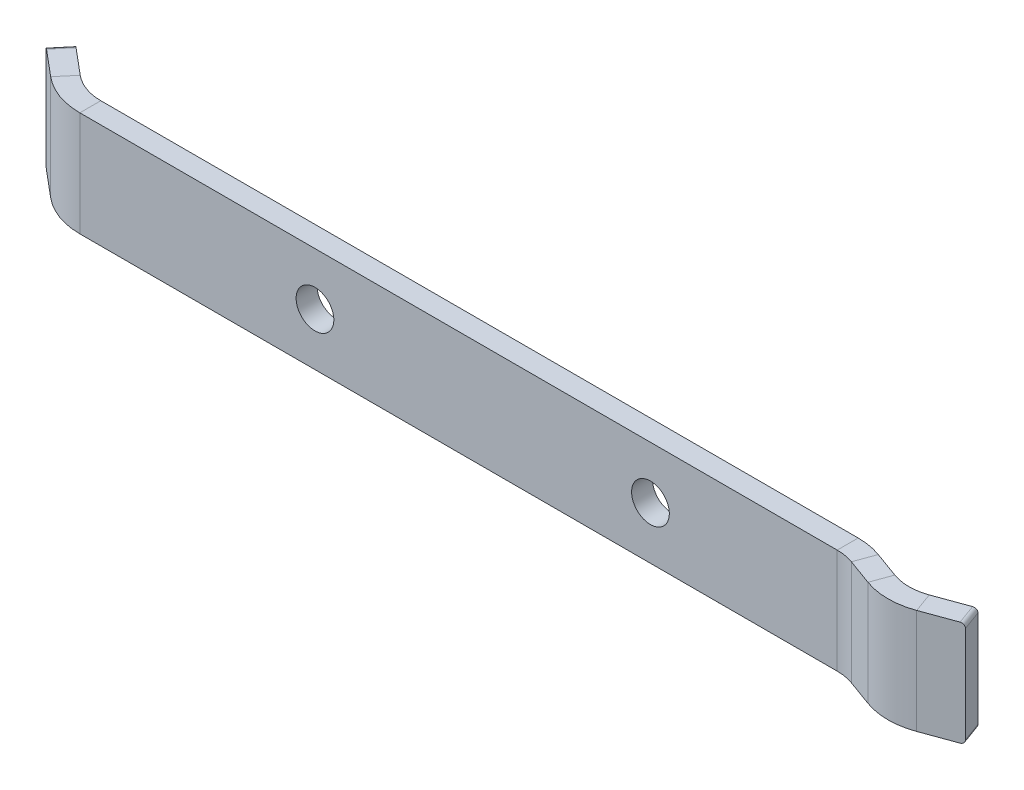
ISO-10303-21;
HEADER;
FILE_DESCRIPTION(('STEP AP214'),'2;1');
FILE_NAME('part.step','',(''),(''),'','','');
FILE_SCHEMA(('AUTOMOTIVE_DESIGN { 1 0 10303 214 1 1 1 1 }'));
ENDSEC;
DATA;
#1=APPLICATION_CONTEXT('core data for automotive mechanical design processes');
#2=APPLICATION_PROTOCOL_DEFINITION('international standard','automotive_design',2000,#1);
#3=PRODUCT_CONTEXT('',#1,'mechanical');
#4=PRODUCT('Part','Part','',(#3));
#5=PRODUCT_RELATED_PRODUCT_CATEGORY('part','',(#4));
#6=PRODUCT_DEFINITION_FORMATION('','',#4);
#7=PRODUCT_DEFINITION_CONTEXT('part definition',#1,'design');
#8=PRODUCT_DEFINITION('design','',#6,#7);
#9=PRODUCT_DEFINITION_SHAPE('','',#8);
#10=(LENGTH_UNIT() NAMED_UNIT(*) SI_UNIT(.MILLI.,.METRE.));
#11=(NAMED_UNIT(*) PLANE_ANGLE_UNIT() SI_UNIT($,.RADIAN.));
#12=(NAMED_UNIT(*) SI_UNIT($,.STERADIAN.) SOLID_ANGLE_UNIT());
#13=UNCERTAINTY_MEASURE_WITH_UNIT(LENGTH_MEASURE(1.E-05),#10,'distance_accuracy_value','');
#14=(GEOMETRIC_REPRESENTATION_CONTEXT(3) GLOBAL_UNCERTAINTY_ASSIGNED_CONTEXT((#13)) GLOBAL_UNIT_ASSIGNED_CONTEXT((#10,
#11,#12)) REPRESENTATION_CONTEXT('',''));
#15=CARTESIAN_POINT('',(0.,0.,0.));
#16=DIRECTION('',(0.,0.,1.));
#17=DIRECTION('',(1.,0.,0.));
#18=AXIS2_PLACEMENT_3D('',#15,#16,#17);
#19=CARTESIAN_POINT('',(1.05402676813538,1.00000000000001,-4.80753218973261));
#20=DIRECTION('',(0.766044443118977,0.,0.642787609686541));
#21=DIRECTION('',(0.642787609686541,0.,-0.766044443118977));
#22=AXIS2_PLACEMENT_3D('',#19,#20,#21);
#23=PLANE('',#22);
#24=DIRECTION('',(0.,-1.,0.));
#25=VECTOR('',#24,1.);
#26=CARTESIAN_POINT('',(4.26796481656809,1.00000000000001,-8.6377544053275));
#27=LINE('',#26,#25);
#28=CARTESIAN_POINT('',(4.26796481656809,24.,-8.63775440532749));
#29=VERTEX_POINT('',#28);
#30=CARTESIAN_POINT('',(4.26796481656809,1.00000000000001,-8.6377544053275));
#31=VERTEX_POINT('',#30);
#32=EDGE_CURVE('E232',#29,#31,#27,.T.);
#33=ORIENTED_EDGE('',*,*,#32,.T.);
#34=DIRECTION('',(0.642787609686541,0.,-0.766044443118977));
#35=VECTOR('',#34,1.);
#36=CARTESIAN_POINT('',(1.05402676813538,1.00000000000001,-4.80753218973261));
#37=LINE('',#36,#35);
#38=CARTESIAN_POINT('',(1.05402676813538,1.00000000000001,-4.80753218973261));
#39=VERTEX_POINT('',#38);
#40=EDGE_CURVE('E247',#39,#31,#37,.T.);
#41=ORIENTED_EDGE('',*,*,#40,.F.);
#42=DIRECTION('',(0.,-1.,0.));
#43=VECTOR('',#42,1.);
#44=CARTESIAN_POINT('',(1.05402676813538,1.00000000000001,-4.80753218973261));
#45=LINE('',#44,#43);
#46=CARTESIAN_POINT('',(1.05402676813538,24.,-4.80753218973261));
#47=VERTEX_POINT('',#46);
#48=EDGE_CURVE('E257',#47,#39,#45,.T.);
#49=ORIENTED_EDGE('',*,*,#48,.F.);
#50=DIRECTION('',(0.642787609686541,0.,-0.766044443118977));
#51=VECTOR('',#50,1.);
#52=CARTESIAN_POINT('',(1.05402676813538,24.,-4.80753218973261));
#53=LINE('',#52,#51);
#54=EDGE_CURVE('E234',#47,#29,#53,.T.);
#55=ORIENTED_EDGE('',*,*,#54,.T.);
#56=EDGE_LOOP('',(#33,#41,#49,#55));
#57=FACE_BOUND('',#56,.T.);
#58=ADVANCED_FACE('F39',(#57),#23,.F.);
#59=CARTESIAN_POINT('',(1.82007121125436,24.,-4.16474458004607));
#60=DIRECTION('',(0.642787609686541,0.,-0.766044443118977));
#61=DIRECTION('',(-0.766044443118977,0.,-0.642787609686541));
#62=AXIS2_PLACEMENT_3D('',#59,#60,#61);
#63=CYLINDRICAL_SURFACE('',#62,1.);
#64=CARTESIAN_POINT('',(5.03400925968706,24.,-7.99496679564095));
#65=DIRECTION('',(-0.642787609686541,0.,0.766044443118977));
#66=DIRECTION('',(-0.766044443118977,0.,-0.642787609686541));
#67=AXIS2_PLACEMENT_3D('',#64,#65,#66);
#68=CIRCLE('',#67,1.);
#69=CARTESIAN_POINT('',(5.03400925968707,25.,-7.99496679564095));
#70=VERTEX_POINT('',#69);
#71=EDGE_CURVE('E239',#70,#29,#68,.T.);
#72=ORIENTED_EDGE('',*,*,#71,.T.);
#73=ORIENTED_EDGE('',*,*,#54,.F.);
#74=CARTESIAN_POINT('',(1.82007121125436,24.,-4.16474458004607));
#75=DIRECTION('',(-0.642787609686541,0.,0.766044443118977));
#76=DIRECTION('',(-0.766044443118977,0.,-0.642787609686541));
#77=AXIS2_PLACEMENT_3D('',#74,#75,#76);
#78=CIRCLE('',#77,1.);
#79=CARTESIAN_POINT('',(1.82007121125436,25.,-4.16474458004606));
#80=VERTEX_POINT('',#79);
#81=EDGE_CURVE('E255',#80,#47,#78,.T.);
#82=ORIENTED_EDGE('',*,*,#81,.F.);
#83=DIRECTION('',(0.642787609686541,0.,-0.766044443118977));
#84=VECTOR('',#83,1.);
#85=CARTESIAN_POINT('',(1.82007121125436,25.,-4.16474458004606));
#86=LINE('',#85,#84);
#87=EDGE_CURVE('E241',#80,#70,#86,.T.);
#88=ORIENTED_EDGE('',*,*,#87,.T.);
#89=EDGE_LOOP('',(#72,#73,#82,#88));
#90=FACE_BOUND('',#89,.T.);
#91=ADVANCED_FACE('F410',(#90),#63,.T.);
#92=CARTESIAN_POINT('',(1.82007121125436,1.,-4.16474458004607));
#93=DIRECTION('',(0.642787609686541,0.,-0.766044443118977));
#94=DIRECTION('',(-0.766044443118977,0.,-0.642787609686541));
#95=AXIS2_PLACEMENT_3D('',#92,#93,#94);
#96=CYLINDRICAL_SURFACE('',#95,1.);
#97=CARTESIAN_POINT('',(5.03400925968706,1.,-7.99496679564095));
#98=DIRECTION('',(-0.642787609686541,0.,0.766044443118977));
#99=DIRECTION('',(-0.766044443118977,0.,-0.642787609686541));
#100=AXIS2_PLACEMENT_3D('',#97,#98,#99);
#101=CIRCLE('',#100,1.);
#102=CARTESIAN_POINT('',(5.03400925968707,0.,-7.99496679564095));
#103=VERTEX_POINT('',#102);
#104=EDGE_CURVE('E244',#31,#103,#101,.T.);
#105=ORIENTED_EDGE('',*,*,#104,.T.);
#106=DIRECTION('',(0.642787609686541,0.,-0.766044443118977));
#107=VECTOR('',#106,1.);
#108=CARTESIAN_POINT('',(1.82007121125437,0.,-4.16474458004606));
#109=LINE('',#108,#107);
#110=CARTESIAN_POINT('',(1.82007121125437,0.,-4.16474458004606));
#111=VERTEX_POINT('',#110);
#112=EDGE_CURVE('E250',#111,#103,#109,.T.);
#113=ORIENTED_EDGE('',*,*,#112,.F.);
#114=CARTESIAN_POINT('',(1.82007121125436,1.,-4.16474458004607));
#115=DIRECTION('',(-0.642787609686541,0.,0.766044443118977));
#116=DIRECTION('',(-0.766044443118977,0.,-0.642787609686541));
#117=AXIS2_PLACEMENT_3D('',#114,#115,#116);
#118=CIRCLE('',#117,1.);
#119=EDGE_CURVE('E208',#39,#111,#118,.T.);
#120=ORIENTED_EDGE('',*,*,#119,.F.);
#121=ORIENTED_EDGE('',*,*,#40,.T.);
#122=EDGE_LOOP('',(#105,#113,#120,#121));
#123=FACE_BOUND('',#122,.T.);
#124=ADVANCED_FACE('F416',(#123),#96,.T.);
#125=CARTESIAN_POINT('',(1.82007121125437,0.,-4.16474458004606));
#126=DIRECTION('',(0.,1.,0.));
#127=DIRECTION('',(-0.642787609686541,0.,0.766044443118977));
#128=AXIS2_PLACEMENT_3D('',#125,#126,#127);
#129=PLANE('',#128);
#130=DIRECTION('',(0.642787609686541,0.,-0.766044443118977));
#131=VECTOR('',#130,1.);
#132=CARTESIAN_POINT('',(8.00229310758681,0.,1.02275553302261));
#133=LINE('',#132,#131);
#134=CARTESIAN_POINT('',(8.0022931075868,0.,1.02275553302261));
#135=VERTEX_POINT('',#134);
#136=CARTESIAN_POINT('',(11.2162311560195,0.,-2.80746668257228));
#137=VERTEX_POINT('',#136);
#138=EDGE_CURVE('E43',#135,#137,#133,.T.);
#139=ORIENTED_EDGE('',*,*,#138,.F.);
#140=DIRECTION('',(0.766044443118977,0.,0.64278760968654));
#141=VECTOR('',#140,1.);
#142=CARTESIAN_POINT('',(1.82007121125437,0.,-4.16474458004606));
#143=LINE('',#142,#141);
#144=EDGE_CURVE('E204',#111,#135,#143,.T.);
#145=ORIENTED_EDGE('',*,*,#144,.F.);
#146=ORIENTED_EDGE('',*,*,#112,.T.);
#147=DIRECTION('',(0.766044443118977,0.,0.64278760968654));
#148=VECTOR('',#147,1.);
#149=CARTESIAN_POINT('',(5.03400925968707,0.,-7.99496679564095));
#150=LINE('',#149,#148);
#151=EDGE_CURVE('E57',#103,#137,#150,.T.);
#152=ORIENTED_EDGE('',*,*,#151,.T.);
#153=EDGE_LOOP('',(#139,#145,#146,#152));
#154=FACE_BOUND('',#153,.T.);
#155=ADVANCED_FACE('F214',(#154),#129,.F.);
#156=CARTESIAN_POINT('',(1.82007121125436,1.,-4.16474458004607));
#157=DIRECTION('',(0.642787609686541,0.,-0.766044443118977));
#158=DIRECTION('',(-0.766044443118977,0.,-0.642787609686541));
#159=AXIS2_PLACEMENT_3D('',#156,#157,#158);
#160=PLANE('',#159);
#161=DIRECTION('',(0.,-1.,0.));
#162=VECTOR('',#161,1.);
#163=CARTESIAN_POINT('',(8.00229310758681,1.,1.02275553302261));
#164=LINE('',#163,#162);
#165=CARTESIAN_POINT('',(8.0022931075868,25.,1.02275553302261));
#166=VERTEX_POINT('',#165);
#167=EDGE_CURVE('E89',#166,#135,#164,.T.);
#168=ORIENTED_EDGE('',*,*,#167,.F.);
#169=DIRECTION('',(-0.766044443118977,0.,-0.64278760968654));
#170=VECTOR('',#169,1.);
#171=CARTESIAN_POINT('',(1.82007121125436,25.,-4.16474458004606));
#172=LINE('',#171,#170);
#173=EDGE_CURVE('E253',#166,#80,#172,.T.);
#174=ORIENTED_EDGE('',*,*,#173,.T.);
#175=ORIENTED_EDGE('',*,*,#81,.T.);
#176=ORIENTED_EDGE('',*,*,#48,.T.);
#177=ORIENTED_EDGE('',*,*,#119,.T.);
#178=ORIENTED_EDGE('',*,*,#144,.T.);
#179=EDGE_LOOP('',(#168,#174,#175,#176,#177,#178));
#180=FACE_BOUND('',#179,.T.);
#181=ADVANCED_FACE('F206',(#180),#160,.F.);
#182=CARTESIAN_POINT('',(1.82007121125436,25.,-4.16474458004606));
#183=DIRECTION('',(0.,-1.,0.));
#184=DIRECTION('',(0.642787609686541,0.,-0.766044443118977));
#185=AXIS2_PLACEMENT_3D('',#182,#183,#184);
#186=PLANE('',#185);
#187=DIRECTION('',(-0.642787609686541,0.,0.766044443118977));
#188=VECTOR('',#187,1.);
#189=CARTESIAN_POINT('',(8.00229310758681,25.,1.02275553302261));
#190=LINE('',#189,#188);
#191=CARTESIAN_POINT('',(11.2162311560195,25.,-2.80746668257227));
#192=VERTEX_POINT('',#191);
#193=EDGE_CURVE('E95',#192,#166,#190,.T.);
#194=ORIENTED_EDGE('',*,*,#193,.F.);
#195=DIRECTION('',(-0.766044443118977,0.,-0.64278760968654));
#196=VECTOR('',#195,1.);
#197=CARTESIAN_POINT('',(5.03400925968707,25.,-7.99496679564095));
#198=LINE('',#197,#196);
#199=EDGE_CURVE('E49',#192,#70,#198,.T.);
#200=ORIENTED_EDGE('',*,*,#199,.T.);
#201=ORIENTED_EDGE('',*,*,#87,.F.);
#202=ORIENTED_EDGE('',*,*,#173,.F.);
#203=EDGE_LOOP('',(#194,#200,#201,#202));
#204=FACE_BOUND('',#203,.T.);
#205=ADVANCED_FACE('F407',(#204),#186,.F.);
#206=CARTESIAN_POINT('',(5.03400925968706,1.,-7.99496679564095));
#207=DIRECTION('',(0.642787609686541,0.,-0.766044443118977));
#208=DIRECTION('',(-0.766044443118977,0.,-0.642787609686541));
#209=AXIS2_PLACEMENT_3D('',#206,#207,#208);
#210=PLANE('',#209);
#211=ORIENTED_EDGE('',*,*,#199,.F.);
#212=DIRECTION('',(0.,-1.,0.));
#213=VECTOR('',#212,1.);
#214=CARTESIAN_POINT('',(11.2162311560195,1.,-2.80746668257228));
#215=LINE('',#214,#213);
#216=EDGE_CURVE('E11',#192,#137,#215,.T.);
#217=ORIENTED_EDGE('',*,*,#216,.T.);
#218=ORIENTED_EDGE('',*,*,#151,.F.);
#219=ORIENTED_EDGE('',*,*,#104,.F.);
#220=ORIENTED_EDGE('',*,*,#32,.F.);
#221=ORIENTED_EDGE('',*,*,#71,.F.);
#222=EDGE_LOOP('',(#211,#217,#218,#219,#220,#221));
#223=FACE_BOUND('',#222,.T.);
#224=ADVANCED_FACE('F41',(#223),#210,.T.);
#225=CARTESIAN_POINT('',(229.998513133861,1.,4.88066319771324));
#226=DIRECTION('',(-0.939692620785908,0.,0.342020143325669));
#227=DIRECTION('',(0.342020143325669,0.,0.939692620785908));
#228=AXIS2_PLACEMENT_3D('',#225,#226,#227);
#229=PLANE('',#228);
#230=DIRECTION('',(0.,1.,0.));
#231=VECTOR('',#230,1.);
#232=CARTESIAN_POINT('',(228.288412417233,1.,0.182200093783669));
#233=LINE('',#232,#231);
#234=CARTESIAN_POINT('',(228.288412417233,1.,0.182200093783669));
#235=VERTEX_POINT('',#234);
#236=CARTESIAN_POINT('',(228.288412417233,24.,0.182200093783669));
#237=VERTEX_POINT('',#236);
#238=EDGE_CURVE('E285',#235,#237,#233,.T.);
#239=ORIENTED_EDGE('',*,*,#238,.T.);
#240=DIRECTION('',(-0.342020143325669,0.,-0.939692620785908));
#241=VECTOR('',#240,1.);
#242=CARTESIAN_POINT('',(229.998513133861,24.,4.88066319771324));
#243=LINE('',#242,#241);
#244=CARTESIAN_POINT('',(229.998513133861,24.,4.88066319771324));
#245=VERTEX_POINT('',#244);
#246=EDGE_CURVE('E296',#245,#237,#243,.T.);
#247=ORIENTED_EDGE('',*,*,#246,.F.);
#248=DIRECTION('',(0.,1.,0.));
#249=VECTOR('',#248,1.);
#250=CARTESIAN_POINT('',(229.998513133861,1.,4.88066319771324));
#251=LINE('',#250,#249);
#252=CARTESIAN_POINT('',(229.998513133861,1.,4.88066319771324));
#253=VERTEX_POINT('',#252);
#254=EDGE_CURVE('E308',#253,#245,#251,.T.);
#255=ORIENTED_EDGE('',*,*,#254,.F.);
#256=DIRECTION('',(-0.342020143325669,0.,-0.939692620785908));
#257=VECTOR('',#256,1.);
#258=CARTESIAN_POINT('',(229.998513133861,1.,4.88066319771324));
#259=LINE('',#258,#257);
#260=EDGE_CURVE('E287',#253,#235,#259,.T.);
#261=ORIENTED_EDGE('',*,*,#260,.T.);
#262=EDGE_LOOP('',(#239,#247,#255,#261));
#263=FACE_BOUND('',#262,.T.);
#264=ADVANCED_FACE('F469',(#263),#229,.F.);
#265=CARTESIAN_POINT('',(229.058820513075,1.,5.2226833410389));
#266=DIRECTION('',(-0.342020143325669,0.,-0.939692620785908));
#267=DIRECTION('',(-0.939692620785908,0.,0.342020143325669));
#268=AXIS2_PLACEMENT_3D('',#265,#266,#267);
#269=CYLINDRICAL_SURFACE('',#268,1.);
#270=CARTESIAN_POINT('',(227.348719796447,1.,0.524220237109352));
#271=DIRECTION('',(0.342020143325669,0.,0.939692620785908));
#272=DIRECTION('',(0.939692620785908,0.,-0.342020143325669));
#273=AXIS2_PLACEMENT_3D('',#270,#271,#272);
#274=CIRCLE('',#273,1.);
#275=CARTESIAN_POINT('',(227.348719796447,0.,0.524220237109352));
#276=VERTEX_POINT('',#275);
#277=EDGE_CURVE('E290',#276,#235,#274,.T.);
#278=ORIENTED_EDGE('',*,*,#277,.T.);
#279=ORIENTED_EDGE('',*,*,#260,.F.);
#280=CARTESIAN_POINT('',(229.058820513075,1.,5.2226833410389));
#281=DIRECTION('',(0.342020143325669,0.,0.939692620785908));
#282=DIRECTION('',(0.939692620785908,0.,-0.342020143325669));
#283=AXIS2_PLACEMENT_3D('',#280,#281,#282);
#284=CIRCLE('',#283,1.);
#285=CARTESIAN_POINT('',(229.058820513075,0.,5.2226833410389));
#286=VERTEX_POINT('',#285);
#287=EDGE_CURVE('E306',#286,#253,#284,.T.);
#288=ORIENTED_EDGE('',*,*,#287,.F.);
#289=DIRECTION('',(-0.342020143325669,0.,-0.939692620785908));
#290=VECTOR('',#289,1.);
#291=CARTESIAN_POINT('',(229.058820513075,0.,5.2226833410389));
#292=LINE('',#291,#290);
#293=EDGE_CURVE('E292',#286,#276,#292,.T.);
#294=ORIENTED_EDGE('',*,*,#293,.T.);
#295=EDGE_LOOP('',(#278,#279,#288,#294));
#296=FACE_BOUND('',#295,.T.);
#297=ADVANCED_FACE('F465',(#296),#269,.T.);
#298=CARTESIAN_POINT('',(229.058820513075,24.,5.2226833410389));
#299=DIRECTION('',(-0.342020143325669,0.,-0.939692620785908));
#300=DIRECTION('',(-0.939692620785908,0.,0.342020143325669));
#301=AXIS2_PLACEMENT_3D('',#298,#299,#300);
#302=CYLINDRICAL_SURFACE('',#301,1.);
#303=CARTESIAN_POINT('',(227.348719796447,24.,0.524220237109352));
#304=DIRECTION('',(0.342020143325669,0.,0.939692620785908));
#305=DIRECTION('',(-0.939692620785908,0.,0.342020143325669));
#306=AXIS2_PLACEMENT_3D('',#303,#304,#305);
#307=CIRCLE('',#306,1.);
#308=CARTESIAN_POINT('',(227.348719796447,25.,0.524220237109352));
#309=VERTEX_POINT('',#308);
#310=EDGE_CURVE('E294',#237,#309,#307,.T.);
#311=ORIENTED_EDGE('',*,*,#310,.T.);
#312=DIRECTION('',(-0.342020143325669,0.,-0.939692620785908));
#313=VECTOR('',#312,1.);
#314=CARTESIAN_POINT('',(229.058820513075,25.,5.2226833410389));
#315=LINE('',#314,#313);
#316=CARTESIAN_POINT('',(229.058820513075,25.,5.2226833410389));
#317=VERTEX_POINT('',#316);
#318=EDGE_CURVE('E299',#317,#309,#315,.T.);
#319=ORIENTED_EDGE('',*,*,#318,.F.);
#320=CARTESIAN_POINT('',(229.058820513075,24.,5.2226833410389));
#321=DIRECTION('',(0.342020143325669,0.,0.939692620785908));
#322=DIRECTION('',(-0.939692620785908,0.,0.342020143325669));
#323=AXIS2_PLACEMENT_3D('',#320,#321,#322);
#324=CIRCLE('',#323,1.);
#325=EDGE_CURVE('E310',#245,#317,#324,.T.);
#326=ORIENTED_EDGE('',*,*,#325,.F.);
#327=ORIENTED_EDGE('',*,*,#246,.T.);
#328=EDGE_LOOP('',(#311,#319,#326,#327));
#329=FACE_BOUND('',#328,.T.);
#330=ADVANCED_FACE('F461',(#329),#302,.T.);
#331=CARTESIAN_POINT('',(14.8089029738881,25.,83.2032760192915));
#332=DIRECTION('',(0.,-1.,0.));
#333=DIRECTION('',(-0.342020143325669,0.,-0.939692620785908));
#334=AXIS2_PLACEMENT_3D('',#331,#332,#333);
#335=PLANE('',#334);
#336=DIRECTION('',(-0.342020143325669,0.,-0.939692620785908));
#337=VECTOR('',#336,1.);
#338=CARTESIAN_POINT('',(221.475202684857,25.,7.98289449856091));
#339=LINE('',#338,#337);
#340=CARTESIAN_POINT('',(221.475202684857,25.,7.9828944985609));
#341=VERTEX_POINT('',#340);
#342=CARTESIAN_POINT('',(219.765101968228,25.,3.28443139463136));
#343=VERTEX_POINT('',#342);
#344=EDGE_CURVE('E278',#341,#343,#339,.T.);
#345=ORIENTED_EDGE('',*,*,#344,.F.);
#346=DIRECTION('',(-0.939692620785908,0.,0.342020143325669));
#347=VECTOR('',#346,1.);
#348=CARTESIAN_POINT('',(14.8089029738881,25.,83.2032760192915));
#349=LINE('',#348,#347);
#350=EDGE_CURVE('E312',#317,#341,#349,.T.);
#351=ORIENTED_EDGE('',*,*,#350,.F.);
#352=ORIENTED_EDGE('',*,*,#318,.T.);
#353=DIRECTION('',(-0.939692620785908,0.,0.342020143325669));
#354=VECTOR('',#353,1.);
#355=CARTESIAN_POINT('',(13.0988022572597,25.,78.504812915362));
#356=LINE('',#355,#354);
#357=EDGE_CURVE('E302',#309,#343,#356,.T.);
#358=ORIENTED_EDGE('',*,*,#357,.T.);
#359=EDGE_LOOP('',(#345,#351,#352,#358));
#360=FACE_BOUND('',#359,.T.);
#361=ADVANCED_FACE('F458',(#360),#335,.F.);
#362=CARTESIAN_POINT('',(14.8089029738881,1.,83.2032760192916));
#363=DIRECTION('',(-0.342020143325669,0.,-0.939692620785908));
#364=DIRECTION('',(-0.939692620785908,0.,0.342020143325669));
#365=AXIS2_PLACEMENT_3D('',#362,#363,#364);
#366=PLANE('',#365);
#367=DIRECTION('',(0.,1.,0.));
#368=VECTOR('',#367,1.);
#369=CARTESIAN_POINT('',(221.475202684857,1.,7.98289449856091));
#370=LINE('',#369,#368);
#371=CARTESIAN_POINT('',(221.475202684857,0.,7.98289449856091));
#372=VERTEX_POINT('',#371);
#373=EDGE_CURVE('E136',#372,#341,#370,.T.);
#374=ORIENTED_EDGE('',*,*,#373,.F.);
#375=DIRECTION('',(0.939692620785908,0.,-0.342020143325669));
#376=VECTOR('',#375,1.);
#377=CARTESIAN_POINT('',(14.8089029738881,0.,83.2032760192915));
#378=LINE('',#377,#376);
#379=EDGE_CURVE('E304',#372,#286,#378,.T.);
#380=ORIENTED_EDGE('',*,*,#379,.T.);
#381=ORIENTED_EDGE('',*,*,#287,.T.);
#382=ORIENTED_EDGE('',*,*,#254,.T.);
#383=ORIENTED_EDGE('',*,*,#325,.T.);
#384=ORIENTED_EDGE('',*,*,#350,.T.);
#385=EDGE_LOOP('',(#374,#380,#381,#382,#383,#384));
#386=FACE_BOUND('',#385,.T.);
#387=ADVANCED_FACE('F455',(#386),#366,.F.);
#388=CARTESIAN_POINT('',(14.8089029738881,0.,83.2032760192915));
#389=DIRECTION('',(0.,1.,0.));
#390=DIRECTION('',(0.342020143325669,0.,0.939692620785908));
#391=AXIS2_PLACEMENT_3D('',#388,#389,#390);
#392=PLANE('',#391);
#393=DIRECTION('',(0.342020143325669,0.,0.939692620785908));
#394=VECTOR('',#393,1.);
#395=CARTESIAN_POINT('',(221.475202684857,0.,7.98289449856091));
#396=LINE('',#395,#394);
#397=CARTESIAN_POINT('',(219.765101968228,0.,3.28443139463136));
#398=VERTEX_POINT('',#397);
#399=EDGE_CURVE('E281',#398,#372,#396,.T.);
#400=ORIENTED_EDGE('',*,*,#399,.F.);
#401=DIRECTION('',(0.939692620785908,0.,-0.342020143325669));
#402=VECTOR('',#401,1.);
#403=CARTESIAN_POINT('',(13.0988022572597,0.,78.504812915362));
#404=LINE('',#403,#402);
#405=EDGE_CURVE('E104',#398,#276,#404,.T.);
#406=ORIENTED_EDGE('',*,*,#405,.T.);
#407=ORIENTED_EDGE('',*,*,#293,.F.);
#408=ORIENTED_EDGE('',*,*,#379,.F.);
#409=EDGE_LOOP('',(#400,#406,#407,#408));
#410=FACE_BOUND('',#409,.T.);
#411=ADVANCED_FACE('F452',(#410),#392,.F.);
#412=CARTESIAN_POINT('',(13.0988022572597,1.,78.504812915362));
#413=DIRECTION('',(-0.342020143325669,0.,-0.939692620785908));
#414=DIRECTION('',(-0.939692620785908,0.,0.342020143325669));
#415=AXIS2_PLACEMENT_3D('',#412,#413,#414);
#416=PLANE('',#415);
#417=ORIENTED_EDGE('',*,*,#405,.F.);
#418=DIRECTION('',(0.,1.,0.));
#419=VECTOR('',#418,1.);
#420=CARTESIAN_POINT('',(219.765101968228,1.,3.28443139463136));
#421=LINE('',#420,#419);
#422=EDGE_CURVE('E142',#398,#343,#421,.T.);
#423=ORIENTED_EDGE('',*,*,#422,.T.);
#424=ORIENTED_EDGE('',*,*,#357,.F.);
#425=ORIENTED_EDGE('',*,*,#310,.F.);
#426=ORIENTED_EDGE('',*,*,#238,.F.);
#427=ORIENTED_EDGE('',*,*,#277,.F.);
#428=EDGE_LOOP('',(#417,#423,#424,#425,#426,#427));
#429=FACE_BOUND('',#428,.T.);
#430=ADVANCED_FACE('F448',(#429),#416,.T.);
#431=CARTESIAN_POINT('',(12.4449905848123,1.,-63.8653856107463));
#432=DIRECTION('',(0.342020143325669,0.,-0.939692620785908));
#433=DIRECTION('',(-0.939692620785908,0.,-0.342020143325669));
#434=AXIS2_PLACEMENT_3D('',#431,#432,#433);
#435=PLANE('',#434);
#436=DIRECTION('',(0.939692620785908,0.,0.342020143325669));
#437=VECTOR('',#436,1.);
#438=CARTESIAN_POINT('',(12.4449905848123,0.,-63.8653856107463));
#439=LINE('',#438,#437);
#440=CARTESIAN_POINT('',(203.639400483779,0.,5.72368855056908));
#441=VERTEX_POINT('',#440);
#442=CARTESIAN_POINT('',(209.846517811784,0.,7.98289449856088));
#443=VERTEX_POINT('',#442);
#444=EDGE_CURVE('E319',#441,#443,#439,.T.);
#445=ORIENTED_EDGE('',*,*,#444,.T.);
#446=DIRECTION('',(0.,1.,0.));
#447=VECTOR('',#446,1.);
#448=CARTESIAN_POINT('',(209.846517811784,1.,7.98289449856089));
#449=LINE('',#448,#447);
#450=CARTESIAN_POINT('',(209.846517811784,25.,7.98289449856088));
#451=VERTEX_POINT('',#450);
#452=EDGE_CURVE('E327',#443,#451,#449,.T.);
#453=ORIENTED_EDGE('',*,*,#452,.T.);
#454=DIRECTION('',(-0.939692620785908,0.,-0.342020143325669));
#455=VECTOR('',#454,1.);
#456=CARTESIAN_POINT('',(12.4449905848123,25.,-63.8653856107463));
#457=LINE('',#456,#455);
#458=CARTESIAN_POINT('',(203.639400483779,25.,5.72368855056908));
#459=VERTEX_POINT('',#458);
#460=EDGE_CURVE('E322',#451,#459,#457,.T.);
#461=ORIENTED_EDGE('',*,*,#460,.T.);
#462=DIRECTION('',(0.,1.,0.));
#463=VECTOR('',#462,1.);
#464=CARTESIAN_POINT('',(203.639400483779,1.,5.72368855056911));
#465=LINE('',#464,#463);
#466=EDGE_CURVE('E324',#441,#459,#465,.T.);
#467=ORIENTED_EDGE('',*,*,#466,.F.);
#468=EDGE_LOOP('',(#445,#453,#461,#467));
#469=FACE_BOUND('',#468,.T.);
#470=ADVANCED_FACE('F451',(#469),#435,.F.);
#471=CARTESIAN_POINT('',(12.4449905848123,0.,-63.8653856107463));
#472=DIRECTION('',(0.,1.,0.));
#473=DIRECTION('',(-0.342020143325669,0.,0.939692620785908));
#474=AXIS2_PLACEMENT_3D('',#471,#472,#473);
#475=PLANE('',#474);
#476=DIRECTION('',(0.939692620785908,0.,0.342020143325669));
#477=VECTOR('',#476,1.);
#478=CARTESIAN_POINT('',(14.1550913014406,0.,-68.5638487146759));
#479=LINE('',#478,#477);
#480=CARTESIAN_POINT('',(205.349501200407,0.,1.02522544663954));
#481=VERTEX_POINT('',#480);
#482=CARTESIAN_POINT('',(211.556618528412,0.,3.28443139463133));
#483=VERTEX_POINT('',#482);
#484=EDGE_CURVE('E320',#481,#483,#479,.T.);
#485=ORIENTED_EDGE('',*,*,#484,.T.);
#486=DIRECTION('',(-0.342020143325669,0.,0.939692620785908));
#487=VECTOR('',#486,1.);
#488=CARTESIAN_POINT('',(209.846517811784,0.,7.98289449856089));
#489=LINE('',#488,#487);
#490=EDGE_CURVE('E150',#483,#443,#489,.T.);
#491=ORIENTED_EDGE('',*,*,#490,.T.);
#492=ORIENTED_EDGE('',*,*,#444,.F.);
#493=DIRECTION('',(-0.342020143325669,0.,0.939692620785908));
#494=VECTOR('',#493,1.);
#495=CARTESIAN_POINT('',(203.639400483779,0.,5.72368855056911));
#496=LINE('',#495,#494);
#497=EDGE_CURVE('E336',#481,#441,#496,.T.);
#498=ORIENTED_EDGE('',*,*,#497,.F.);
#499=EDGE_LOOP('',(#485,#491,#492,#498));
#500=FACE_BOUND('',#499,.T.);
#501=ADVANCED_FACE('F479',(#500),#475,.F.);
#502=CARTESIAN_POINT('',(12.4449905848123,25.,-63.8653856107463));
#503=DIRECTION('',(0.,-1.,0.));
#504=DIRECTION('',(0.342020143325669,0.,-0.939692620785908));
#505=AXIS2_PLACEMENT_3D('',#502,#503,#504);
#506=PLANE('',#505);
#507=ORIENTED_EDGE('',*,*,#460,.F.);
#508=DIRECTION('',(0.342020143325669,0.,-0.939692620785908));
#509=VECTOR('',#508,1.);
#510=CARTESIAN_POINT('',(209.846517811784,25.,7.98289449856089));
#511=LINE('',#510,#509);
#512=CARTESIAN_POINT('',(211.556618528412,25.,3.28443139463132));
#513=VERTEX_POINT('',#512);
#514=EDGE_CURVE('E330',#451,#513,#511,.T.);
#515=ORIENTED_EDGE('',*,*,#514,.T.);
#516=DIRECTION('',(-0.939692620785908,0.,-0.342020143325669));
#517=VECTOR('',#516,1.);
#518=CARTESIAN_POINT('',(14.1550913014406,25.,-68.5638487146759));
#519=LINE('',#518,#517);
#520=CARTESIAN_POINT('',(205.349501200407,25.,1.02522544663955));
#521=VERTEX_POINT('',#520);
#522=EDGE_CURVE('E316',#513,#521,#519,.T.);
#523=ORIENTED_EDGE('',*,*,#522,.T.);
#524=DIRECTION('',(0.342020143325669,0.,-0.939692620785908));
#525=VECTOR('',#524,1.);
#526=CARTESIAN_POINT('',(203.639400483779,25.,5.72368855056911));
#527=LINE('',#526,#525);
#528=EDGE_CURVE('E333',#459,#521,#527,.T.);
#529=ORIENTED_EDGE('',*,*,#528,.F.);
#530=EDGE_LOOP('',(#507,#515,#523,#529));
#531=FACE_BOUND('',#530,.T.);
#532=ADVANCED_FACE('F478',(#531),#506,.F.);
#533=CARTESIAN_POINT('',(14.1550913014406,1.,-68.5638487146759));
#534=DIRECTION('',(0.342020143325669,0.,-0.939692620785908));
#535=DIRECTION('',(-0.939692620785908,0.,-0.342020143325669));
#536=AXIS2_PLACEMENT_3D('',#533,#534,#535);
#537=PLANE('',#536);
#538=DIRECTION('',(0.,1.,0.));
#539=VECTOR('',#538,1.);
#540=CARTESIAN_POINT('',(211.556618528412,1.,3.28443139463135));
#541=LINE('',#540,#539);
#542=EDGE_CURVE('E158',#483,#513,#541,.T.);
#543=ORIENTED_EDGE('',*,*,#542,.F.);
#544=ORIENTED_EDGE('',*,*,#484,.F.);
#545=DIRECTION('',(0.,1.,0.));
#546=VECTOR('',#545,1.);
#547=CARTESIAN_POINT('',(205.349501200407,1.,1.02522544663956));
#548=LINE('',#547,#546);
#549=EDGE_CURVE('E339',#481,#521,#548,.T.);
#550=ORIENTED_EDGE('',*,*,#549,.T.);
#551=ORIENTED_EDGE('',*,*,#522,.F.);
#552=EDGE_LOOP('',(#543,#544,#550,#551));
#553=FACE_BOUND('',#552,.T.);
#554=ADVANCED_FACE('F474',(#553),#537,.T.);
#555=CARTESIAN_POINT('',(155.,12.5,5.));
#556=DIRECTION('',(0.,0.,-1.));
#557=DIRECTION('',(-1.,0.,0.));
#558=AXIS2_PLACEMENT_3D('',#555,#556,#557);
#559=CYLINDRICAL_SURFACE('',#558,4.49999999999999);
#560=CARTESIAN_POINT('',(155.,12.5,5.));
#561=DIRECTION('',(0.,0.,1.));
#562=DIRECTION('',(1.,0.,0.));
#563=AXIS2_PLACEMENT_3D('',#560,#561,#562);
#564=CIRCLE('',#563,4.49999999999999);
#565=CARTESIAN_POINT('',(159.5,12.5,5.));
#566=VERTEX_POINT('',#565);
#567=EDGE_CURVE('E350',#566,#566,#564,.T.);
#568=ORIENTED_EDGE('',*,*,#567,.T.);
#569=EDGE_LOOP('',(#568));
#570=FACE_BOUND('',#569,.T.);
#571=CARTESIAN_POINT('',(155.,12.5,0.));
#572=DIRECTION('',(0.,0.,1.));
#573=DIRECTION('',(1.,0.,0.));
#574=AXIS2_PLACEMENT_3D('',#571,#572,#573);
#575=CIRCLE('',#574,4.49999999999999);
#576=CARTESIAN_POINT('',(159.5,12.5,0.));
#577=VERTEX_POINT('',#576);
#578=EDGE_CURVE('E365',#577,#577,#575,.T.);
#579=ORIENTED_EDGE('',*,*,#578,.F.);
#580=EDGE_LOOP('',(#579));
#581=FACE_BOUND('',#580,.T.);
#582=ADVANCED_FACE('F477',(#570,#581),#559,.F.);
#583=CARTESIAN_POINT('',(75.,12.5,5.));
#584=DIRECTION('',(0.,0.,-1.));
#585=DIRECTION('',(-1.,0.,0.));
#586=AXIS2_PLACEMENT_3D('',#583,#584,#585);
#587=CYLINDRICAL_SURFACE('',#586,4.5);
#588=CARTESIAN_POINT('',(75.,12.5,5.));
#589=DIRECTION('',(0.,0.,1.));
#590=DIRECTION('',(1.,0.,0.));
#591=AXIS2_PLACEMENT_3D('',#588,#589,#590);
#592=CIRCLE('',#591,4.5);
#593=CARTESIAN_POINT('',(79.5,12.5,5.));
#594=VERTEX_POINT('',#593);
#595=EDGE_CURVE('E269',#594,#594,#592,.T.);
#596=ORIENTED_EDGE('',*,*,#595,.T.);
#597=EDGE_LOOP('',(#596));
#598=FACE_BOUND('',#597,.T.);
#599=CARTESIAN_POINT('',(75.,12.5,0.));
#600=DIRECTION('',(0.,0.,1.));
#601=DIRECTION('',(1.,0.,0.));
#602=AXIS2_PLACEMENT_3D('',#599,#600,#601);
#603=CIRCLE('',#602,4.5);
#604=CARTESIAN_POINT('',(79.5,12.5,0.));
#605=VERTEX_POINT('',#604);
#606=EDGE_CURVE('E362',#605,#605,#603,.T.);
#607=ORIENTED_EDGE('',*,*,#606,.F.);
#608=EDGE_LOOP('',(#607));
#609=FACE_BOUND('',#608,.T.);
#610=ADVANCED_FACE('F442',(#598,#609),#587,.F.);
#611=CARTESIAN_POINT('',(1.,1.,5.));
#612=DIRECTION('',(0.,0.,-1.));
#613=DIRECTION('',(-1.,0.,0.));
#614=AXIS2_PLACEMENT_3D('',#611,#612,#613);
#615=PLANE('',#614);
#616=ORIENTED_EDGE('',*,*,#595,.F.);
#617=EDGE_LOOP('',(#616));
#618=FACE_BOUND('',#617,.T.);
#619=ORIENTED_EDGE('',*,*,#567,.F.);
#620=EDGE_LOOP('',(#619));
#621=FACE_BOUND('',#620,.T.);
#622=DIRECTION('',(-1.,0.,0.));
#623=VECTOR('',#622,1.);
#624=CARTESIAN_POINT('',(1.00000000000001,25.,5.));
#625=LINE('',#624,#623);
#626=CARTESIAN_POINT('',(199.535158763871,25.,5.00000000000001));
#627=VERTEX_POINT('',#626);
#628=CARTESIAN_POINT('',(18.929682472258,25.,5.));
#629=VERTEX_POINT('',#628);
#630=EDGE_CURVE('E265',#627,#629,#625,.T.);
#631=ORIENTED_EDGE('',*,*,#630,.T.);
#632=DIRECTION('',(0.,-1.,0.));
#633=VECTOR('',#632,1.);
#634=CARTESIAN_POINT('',(18.929682472258,1.,5.));
#635=LINE('',#634,#633);
#636=CARTESIAN_POINT('',(18.929682472258,0.,5.));
#637=VERTEX_POINT('',#636);
#638=EDGE_CURVE('E268',#629,#637,#635,.T.);
#639=ORIENTED_EDGE('',*,*,#638,.T.);
#640=DIRECTION('',(1.,0.,0.));
#641=VECTOR('',#640,1.);
#642=CARTESIAN_POINT('',(1.00000000000001,0.,5.));
#643=LINE('',#642,#641);
#644=CARTESIAN_POINT('',(199.535158763871,0.,5.00000000000001));
#645=VERTEX_POINT('',#644);
#646=EDGE_CURVE('E270',#637,#645,#643,.T.);
#647=ORIENTED_EDGE('',*,*,#646,.T.);
#648=DIRECTION('',(0.,1.,0.));
#649=VECTOR('',#648,1.);
#650=CARTESIAN_POINT('',(199.535158763871,1.,5.));
#651=LINE('',#650,#649);
#652=EDGE_CURVE('E273',#645,#627,#651,.T.);
#653=ORIENTED_EDGE('',*,*,#652,.T.);
#654=EDGE_LOOP('',(#631,#639,#647,#653));
#655=FACE_BOUND('',#654,.T.);
#656=ADVANCED_FACE('F438',(#618,#621,#655),#615,.F.);
#657=CARTESIAN_POINT('',(1.00000000000001,25.,5.));
#658=DIRECTION('',(0.,-1.,0.));
#659=DIRECTION('',(0.,0.,-1.));
#660=AXIS2_PLACEMENT_3D('',#657,#658,#659);
#661=PLANE('',#660);
#662=DIRECTION('',(-1.,0.,0.));
#663=VECTOR('',#662,1.);
#664=CARTESIAN_POINT('',(1.00000000000001,25.,0.));
#665=LINE('',#664,#663);
#666=CARTESIAN_POINT('',(199.535158763871,25.,0.));
#667=VERTEX_POINT('',#666);
#668=CARTESIAN_POINT('',(18.929682472258,25.,0.));
#669=VERTEX_POINT('',#668);
#670=EDGE_CURVE('E274',#667,#669,#665,.T.);
#671=ORIENTED_EDGE('',*,*,#670,.T.);
#672=DIRECTION('',(0.,0.,1.));
#673=VECTOR('',#672,1.);
#674=CARTESIAN_POINT('',(18.929682472258,25.,5.));
#675=LINE('',#674,#673);
#676=EDGE_CURVE('E277',#669,#629,#675,.T.);
#677=ORIENTED_EDGE('',*,*,#676,.T.);
#678=ORIENTED_EDGE('',*,*,#630,.F.);
#679=DIRECTION('',(0.,0.,-1.));
#680=VECTOR('',#679,1.);
#681=CARTESIAN_POINT('',(199.535158763871,25.,5.));
#682=LINE('',#681,#680);
#683=EDGE_CURVE('E359',#627,#667,#682,.T.);
#684=ORIENTED_EDGE('',*,*,#683,.T.);
#685=EDGE_LOOP('',(#671,#677,#678,#684));
#686=FACE_BOUND('',#685,.T.);
#687=ADVANCED_FACE('F434',(#686),#661,.F.);
#688=CARTESIAN_POINT('',(1.,1.,0.));
#689=DIRECTION('',(0.,0.,-1.));
#690=DIRECTION('',(-1.,0.,0.));
#691=AXIS2_PLACEMENT_3D('',#688,#689,#690);
#692=PLANE('',#691);
#693=DIRECTION('',(0.,-1.,0.));
#694=VECTOR('',#693,1.);
#695=CARTESIAN_POINT('',(18.929682472258,1.,0.));
#696=LINE('',#695,#694);
#697=CARTESIAN_POINT('',(18.929682472258,0.,0.));
#698=VERTEX_POINT('',#697);
#699=EDGE_CURVE('E346',#669,#698,#696,.T.);
#700=ORIENTED_EDGE('',*,*,#699,.F.);
#701=ORIENTED_EDGE('',*,*,#670,.F.);
#702=DIRECTION('',(0.,1.,0.));
#703=VECTOR('',#702,1.);
#704=CARTESIAN_POINT('',(199.535158763871,1.,0.));
#705=LINE('',#704,#703);
#706=CARTESIAN_POINT('',(199.535158763871,0.,0.));
#707=VERTEX_POINT('',#706);
#708=EDGE_CURVE('E343',#707,#667,#705,.T.);
#709=ORIENTED_EDGE('',*,*,#708,.F.);
#710=DIRECTION('',(1.,0.,0.));
#711=VECTOR('',#710,1.);
#712=CARTESIAN_POINT('',(1.00000000000001,0.,0.));
#713=LINE('',#712,#711);
#714=EDGE_CURVE('E261',#698,#707,#713,.T.);
#715=ORIENTED_EDGE('',*,*,#714,.F.);
#716=EDGE_LOOP('',(#700,#701,#709,#715));
#717=FACE_BOUND('',#716,.T.);
#718=ORIENTED_EDGE('',*,*,#606,.T.);
#719=EDGE_LOOP('',(#718));
#720=FACE_BOUND('',#719,.T.);
#721=ORIENTED_EDGE('',*,*,#578,.T.);
#722=EDGE_LOOP('',(#721));
#723=FACE_BOUND('',#722,.T.);
#724=ADVANCED_FACE('F430',(#717,#720,#723),#692,.T.);
#725=CARTESIAN_POINT('',(1.00000000000001,0.,5.));
#726=DIRECTION('',(0.,1.,0.));
#727=DIRECTION('',(0.,0.,1.));
#728=AXIS2_PLACEMENT_3D('',#725,#726,#727);
#729=PLANE('',#728);
#730=ORIENTED_EDGE('',*,*,#646,.F.);
#731=DIRECTION('',(0.,0.,-1.));
#732=VECTOR('',#731,1.);
#733=CARTESIAN_POINT('',(18.929682472258,0.,5.));
#734=LINE('',#733,#732);
#735=EDGE_CURVE('E223',#637,#698,#734,.T.);
#736=ORIENTED_EDGE('',*,*,#735,.T.);
#737=ORIENTED_EDGE('',*,*,#714,.T.);
#738=DIRECTION('',(0.,0.,1.));
#739=VECTOR('',#738,1.);
#740=CARTESIAN_POINT('',(199.535158763871,0.,5.));
#741=LINE('',#740,#739);
#742=EDGE_CURVE('E264',#707,#645,#741,.T.);
#743=ORIENTED_EDGE('',*,*,#742,.T.);
#744=EDGE_LOOP('',(#730,#736,#737,#743));
#745=FACE_BOUND('',#744,.T.);
#746=ADVANCED_FACE('F433',(#745),#729,.F.);
#747=CARTESIAN_POINT('',(199.535158763871,0.,17.));
#748=DIRECTION('',(0.,1.,0.));
#749=DIRECTION('',(0.,0.,1.));
#750=AXIS2_PLACEMENT_3D('',#747,#748,#749);
#751=PLANE('',#750);
#752=ORIENTED_EDGE('',*,*,#497,.T.);
#753=CARTESIAN_POINT('',(199.535158763871,0.,17.));
#754=DIRECTION('',(0.,1.,0.));
#755=DIRECTION('',(0.,0.,1.));
#756=AXIS2_PLACEMENT_3D('',#753,#754,#755);
#757=CIRCLE('',#756,12.);
#758=EDGE_CURVE('E371',#645,#441,#757,.F.);
#759=ORIENTED_EDGE('',*,*,#758,.F.);
#760=ORIENTED_EDGE('',*,*,#742,.F.);
#761=CARTESIAN_POINT('',(199.535158763871,0.,17.));
#762=DIRECTION('',(0.,1.,0.));
#763=DIRECTION('',(0.,0.,1.));
#764=AXIS2_PLACEMENT_3D('',#761,#762,#763);
#765=CIRCLE('',#764,17.);
#766=EDGE_CURVE('E378',#707,#481,#765,.F.);
#767=ORIENTED_EDGE('',*,*,#766,.T.);
#768=EDGE_LOOP('',(#752,#759,#760,#767));
#769=FACE_BOUND('',#768,.T.);
#770=ADVANCED_FACE('F446',(#769),#751,.F.);
#771=CARTESIAN_POINT('',(199.535158763871,25.,17.));
#772=DIRECTION('',(0.,-1.,0.));
#773=DIRECTION('',(0.,0.,-1.));
#774=AXIS2_PLACEMENT_3D('',#771,#772,#773);
#775=PLANE('',#774);
#776=ORIENTED_EDGE('',*,*,#683,.F.);
#777=CARTESIAN_POINT('',(199.535158763871,25.,17.));
#778=DIRECTION('',(0.,1.,0.));
#779=DIRECTION('',(0.,0.,1.));
#780=AXIS2_PLACEMENT_3D('',#777,#778,#779);
#781=CIRCLE('',#780,12.);
#782=EDGE_CURVE('E374',#459,#627,#781,.T.);
#783=ORIENTED_EDGE('',*,*,#782,.F.);
#784=ORIENTED_EDGE('',*,*,#528,.T.);
#785=CARTESIAN_POINT('',(199.535158763871,25.,17.));
#786=DIRECTION('',(0.,1.,0.));
#787=DIRECTION('',(0.,0.,1.));
#788=AXIS2_PLACEMENT_3D('',#785,#786,#787);
#789=CIRCLE('',#788,17.);
#790=EDGE_CURVE('E347',#521,#667,#789,.T.);
#791=ORIENTED_EDGE('',*,*,#790,.T.);
#792=EDGE_LOOP('',(#776,#783,#784,#791));
#793=FACE_BOUND('',#792,.T.);
#794=ADVANCED_FACE('F496',(#793),#775,.F.);
#795=CARTESIAN_POINT('',(199.535158763871,-231.408729308123,17.));
#796=DIRECTION('',(0.,1.,0.));
#797=DIRECTION('',(0.,0.,1.));
#798=AXIS2_PLACEMENT_3D('',#795,#796,#797);
#799=CYLINDRICAL_SURFACE('',#798,17.);
#800=ORIENTED_EDGE('',*,*,#790,.F.);
#801=ORIENTED_EDGE('',*,*,#549,.F.);
#802=ORIENTED_EDGE('',*,*,#766,.F.);
#803=ORIENTED_EDGE('',*,*,#708,.T.);
#804=EDGE_LOOP('',(#800,#801,#802,#803));
#805=FACE_BOUND('',#804,.T.);
#806=ADVANCED_FACE('F500',(#805),#799,.T.);
#807=CARTESIAN_POINT('',(199.535158763871,-231.408729308123,17.));
#808=DIRECTION('',(0.,1.,0.));
#809=DIRECTION('',(0.,0.,1.));
#810=AXIS2_PLACEMENT_3D('',#807,#808,#809);
#811=CYLINDRICAL_SURFACE('',#810,12.);
#812=ORIENTED_EDGE('',*,*,#782,.T.);
#813=ORIENTED_EDGE('',*,*,#652,.F.);
#814=ORIENTED_EDGE('',*,*,#758,.T.);
#815=ORIENTED_EDGE('',*,*,#466,.T.);
#816=EDGE_LOOP('',(#812,#813,#814,#815));
#817=FACE_BOUND('',#816,.T.);
#818=ADVANCED_FACE('F502',(#817),#811,.F.);
#819=CARTESIAN_POINT('',(215.66086024832,25.,-7.99188005479955));
#820=DIRECTION('',(0.,1.,0.));
#821=DIRECTION('',(0.,0.,1.));
#822=AXIS2_PLACEMENT_3D('',#819,#820,#821);
#823=PLANE('',#822);
#824=ORIENTED_EDGE('',*,*,#344,.T.);
#825=CARTESIAN_POINT('',(215.66086024832,25.,-7.99188005479955));
#826=DIRECTION('',(0.,-1.,0.));
#827=DIRECTION('',(0.,0.,-1.));
#828=AXIS2_PLACEMENT_3D('',#825,#826,#827);
#829=CIRCLE('',#828,12.);
#830=EDGE_CURVE('E382',#343,#513,#829,.T.);
#831=ORIENTED_EDGE('',*,*,#830,.T.);
#832=ORIENTED_EDGE('',*,*,#514,.F.);
#833=CARTESIAN_POINT('',(215.66086024832,25.,-7.99188005479955));
#834=DIRECTION('',(0.,-1.,0.));
#835=DIRECTION('',(0.,0.,-1.));
#836=AXIS2_PLACEMENT_3D('',#833,#834,#835);
#837=CIRCLE('',#836,17.);
#838=EDGE_CURVE('E375',#341,#451,#837,.T.);
#839=ORIENTED_EDGE('',*,*,#838,.F.);
#840=EDGE_LOOP('',(#824,#831,#832,#839));
#841=FACE_BOUND('',#840,.T.);
#842=ADVANCED_FACE('F505',(#841),#823,.T.);
#843=CARTESIAN_POINT('',(215.66086024832,0.,-7.99188005479955));
#844=DIRECTION('',(0.,-1.,0.));
#845=DIRECTION('',(0.,0.,-1.));
#846=AXIS2_PLACEMENT_3D('',#843,#844,#845);
#847=PLANE('',#846);
#848=ORIENTED_EDGE('',*,*,#490,.F.);
#849=CARTESIAN_POINT('',(215.66086024832,1.11022302462516E-13,-7.99188005479955));
#850=DIRECTION('',(0.,-1.,0.));
#851=DIRECTION('',(0.,0.,-1.));
#852=AXIS2_PLACEMENT_3D('',#849,#850,#851);
#853=CIRCLE('',#852,12.);
#854=EDGE_CURVE('E226',#483,#398,#853,.F.);
#855=ORIENTED_EDGE('',*,*,#854,.T.);
#856=ORIENTED_EDGE('',*,*,#399,.T.);
#857=CARTESIAN_POINT('',(215.66086024832,1.11022302462516E-13,-7.99188005479955));
#858=DIRECTION('',(0.,-1.,0.));
#859=DIRECTION('',(0.,0.,-1.));
#860=AXIS2_PLACEMENT_3D('',#857,#858,#859);
#861=CIRCLE('',#860,17.);
#862=EDGE_CURVE('E385',#443,#372,#861,.F.);
#863=ORIENTED_EDGE('',*,*,#862,.F.);
#864=EDGE_LOOP('',(#848,#855,#856,#863));
#865=FACE_BOUND('',#864,.T.);
#866=ADVANCED_FACE('F512',(#865),#847,.T.);
#867=CARTESIAN_POINT('',(215.66086024832,256.155799207051,-7.99188005479955));
#868=DIRECTION('',(0.,-1.,0.));
#869=DIRECTION('',(0.,0.,-1.));
#870=AXIS2_PLACEMENT_3D('',#867,#868,#869);
#871=CYLINDRICAL_SURFACE('',#870,17.);
#872=ORIENTED_EDGE('',*,*,#862,.T.);
#873=ORIENTED_EDGE('',*,*,#373,.T.);
#874=ORIENTED_EDGE('',*,*,#838,.T.);
#875=ORIENTED_EDGE('',*,*,#452,.F.);
#876=EDGE_LOOP('',(#872,#873,#874,#875));
#877=FACE_BOUND('',#876,.T.);
#878=ADVANCED_FACE('F516',(#877),#871,.T.);
#879=CARTESIAN_POINT('',(215.66086024832,256.155799207051,-7.99188005479955));
#880=DIRECTION('',(0.,-1.,0.));
#881=DIRECTION('',(0.,0.,-1.));
#882=AXIS2_PLACEMENT_3D('',#879,#880,#881);
#883=CYLINDRICAL_SURFACE('',#882,12.);
#884=ORIENTED_EDGE('',*,*,#854,.F.);
#885=ORIENTED_EDGE('',*,*,#542,.T.);
#886=ORIENTED_EDGE('',*,*,#830,.F.);
#887=ORIENTED_EDGE('',*,*,#422,.F.);
#888=EDGE_LOOP('',(#884,#885,#886,#887));
#889=FACE_BOUND('',#888,.T.);
#890=ADVANCED_FACE('F518',(#889),#883,.F.);
#891=CARTESIAN_POINT('',(18.929682472258,0.,-12.));
#892=DIRECTION('',(0.,-1.,0.));
#893=DIRECTION('',(0.,0.,-1.));
#894=AXIS2_PLACEMENT_3D('',#891,#892,#893);
#895=PLANE('',#894);
#896=ORIENTED_EDGE('',*,*,#138,.T.);
#897=CARTESIAN_POINT('',(18.929682472258,0.,-12.));
#898=DIRECTION('',(0.,1.,0.));
#899=DIRECTION('',(-1.,0.,0.));
#900=AXIS2_PLACEMENT_3D('',#897,#898,#899);
#901=CIRCLE('',#900,12.);
#902=EDGE_CURVE('E392',#137,#698,#901,.T.);
#903=ORIENTED_EDGE('',*,*,#902,.T.);
#904=ORIENTED_EDGE('',*,*,#735,.F.);
#905=CARTESIAN_POINT('',(18.929682472258,0.,-12.));
#906=DIRECTION('',(0.,1.,0.));
#907=DIRECTION('',(-1.,0.,0.));
#908=AXIS2_PLACEMENT_3D('',#905,#906,#907);
#909=CIRCLE('',#908,17.);
#910=EDGE_CURVE('E220',#135,#637,#909,.T.);
#911=ORIENTED_EDGE('',*,*,#910,.F.);
#912=EDGE_LOOP('',(#896,#903,#904,#911));
#913=FACE_BOUND('',#912,.T.);
#914=ADVANCED_FACE('F221',(#913),#895,.T.);
#915=CARTESIAN_POINT('',(18.929682472258,25.,-12.));
#916=DIRECTION('',(0.,1.,0.));
#917=DIRECTION('',(0.,0.,1.));
#918=AXIS2_PLACEMENT_3D('',#915,#916,#917);
#919=PLANE('',#918);
#920=ORIENTED_EDGE('',*,*,#676,.F.);
#921=CARTESIAN_POINT('',(18.929682472258,25.,-12.));
#922=DIRECTION('',(0.,1.,0.));
#923=DIRECTION('',(-1.,0.,0.));
#924=AXIS2_PLACEMENT_3D('',#921,#922,#923);
#925=CIRCLE('',#924,12.);
#926=EDGE_CURVE('E394',#669,#192,#925,.F.);
#927=ORIENTED_EDGE('',*,*,#926,.T.);
#928=ORIENTED_EDGE('',*,*,#193,.T.);
#929=CARTESIAN_POINT('',(18.929682472258,25.,-12.));
#930=DIRECTION('',(0.,1.,0.));
#931=DIRECTION('',(-1.,0.,0.));
#932=AXIS2_PLACEMENT_3D('',#929,#930,#931);
#933=CIRCLE('',#932,17.);
#934=EDGE_CURVE('E227',#629,#166,#933,.F.);
#935=ORIENTED_EDGE('',*,*,#934,.F.);
#936=EDGE_LOOP('',(#920,#927,#928,#935));
#937=FACE_BOUND('',#936,.T.);
#938=ADVANCED_FACE('F401',(#937),#919,.T.);
#939=CARTESIAN_POINT('',(18.929682472258,-231.528534459004,-12.));
#940=DIRECTION('',(0.,1.,0.));
#941=DIRECTION('',(-1.,0.,0.));
#942=AXIS2_PLACEMENT_3D('',#939,#940,#941);
#943=CYLINDRICAL_SURFACE('',#942,17.);
#944=ORIENTED_EDGE('',*,*,#934,.T.);
#945=ORIENTED_EDGE('',*,*,#167,.T.);
#946=ORIENTED_EDGE('',*,*,#910,.T.);
#947=ORIENTED_EDGE('',*,*,#638,.F.);
#948=EDGE_LOOP('',(#944,#945,#946,#947));
#949=FACE_BOUND('',#948,.T.);
#950=ADVANCED_FACE('F230',(#949),#943,.T.);
#951=CARTESIAN_POINT('',(18.929682472258,-231.528534459004,-12.));
#952=DIRECTION('',(0.,1.,0.));
#953=DIRECTION('',(-1.,0.,0.));
#954=AXIS2_PLACEMENT_3D('',#951,#952,#953);
#955=CYLINDRICAL_SURFACE('',#954,12.);
#956=ORIENTED_EDGE('',*,*,#926,.F.);
#957=ORIENTED_EDGE('',*,*,#699,.T.);
#958=ORIENTED_EDGE('',*,*,#902,.F.);
#959=ORIENTED_EDGE('',*,*,#216,.F.);
#960=EDGE_LOOP('',(#956,#957,#958,#959));
#961=FACE_BOUND('',#960,.T.);
#962=ADVANCED_FACE('F403',(#961),#955,.F.);
#963=CLOSED_SHELL('',(#58,#91,#124,#155,#181,#205,#224,#264,#297,#330,#361,#387,#411,#430,#470,
#501,#532,#554,#582,#610,#656,#687,#724,#746,#770,#794,#806,#818,#842,#866,#878,#890,#914,#938,
#950,#962));
#964=MANIFOLD_SOLID_BREP('B2',#963);
#965=ADVANCED_BREP_SHAPE_REPRESENTATION('',(#18,#964),#14);
#966=SHAPE_DEFINITION_REPRESENTATION(#9,#965);
ENDSEC;
END-ISO-10303-21;
